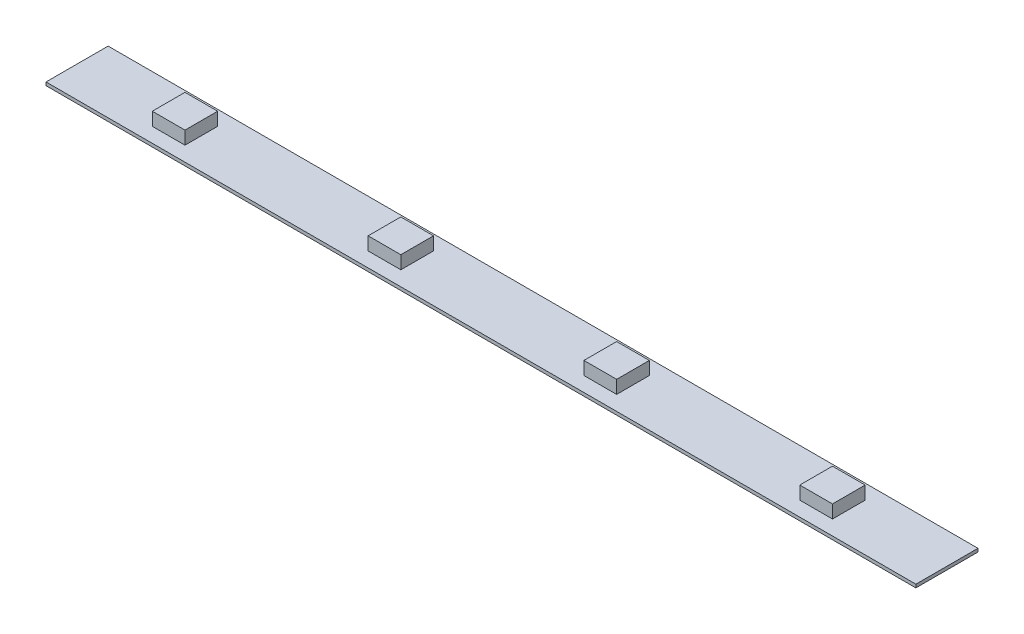
ISO-10303-21;
HEADER;
FILE_DESCRIPTION(('STEP AP214'),'2;1');
FILE_NAME('part.step','',(''),(''),'','','');
FILE_SCHEMA(('AUTOMOTIVE_DESIGN { 1 0 10303 214 1 1 1 1 }'));
ENDSEC;
DATA;
#1=APPLICATION_CONTEXT('core data for automotive mechanical design processes');
#2=APPLICATION_PROTOCOL_DEFINITION('international standard','automotive_design',2000,#1);
#3=PRODUCT_CONTEXT('',#1,'mechanical');
#4=PRODUCT('Part','Part','',(#3));
#5=PRODUCT_RELATED_PRODUCT_CATEGORY('part','',(#4));
#6=PRODUCT_DEFINITION_FORMATION('','',#4);
#7=PRODUCT_DEFINITION_CONTEXT('part definition',#1,'design');
#8=PRODUCT_DEFINITION('design','',#6,#7);
#9=PRODUCT_DEFINITION_SHAPE('','',#8);
#10=(LENGTH_UNIT() NAMED_UNIT(*) SI_UNIT(.MILLI.,.METRE.));
#11=(NAMED_UNIT(*) PLANE_ANGLE_UNIT() SI_UNIT($,.RADIAN.));
#12=(NAMED_UNIT(*) SI_UNIT($,.STERADIAN.) SOLID_ANGLE_UNIT());
#13=UNCERTAINTY_MEASURE_WITH_UNIT(LENGTH_MEASURE(1.E-05),#10,'distance_accuracy_value','');
#14=(GEOMETRIC_REPRESENTATION_CONTEXT(3) GLOBAL_UNCERTAINTY_ASSIGNED_CONTEXT((#13)) GLOBAL_UNIT_ASSIGNED_CONTEXT((#10,
#11,#12)) REPRESENTATION_CONTEXT('',''));
#15=CARTESIAN_POINT('',(0.,0.,0.));
#16=DIRECTION('',(0.,0.,1.));
#17=DIRECTION('',(1.,0.,0.));
#18=AXIS2_PLACEMENT_3D('',#15,#16,#17);
#19=CARTESIAN_POINT('',(0.,0.5,0.));
#20=DIRECTION('',(0.,-1.,0.));
#21=DIRECTION('',(0.,0.,-1.));
#22=AXIS2_PLACEMENT_3D('',#19,#20,#21);
#23=PLANE('',#22);
#24=DIRECTION('',(0.,0.,1.));
#25=VECTOR('',#24,1.);
#26=CARTESIAN_POINT('',(80.,0.5,-7.25));
#27=LINE('',#26,#25);
#28=CARTESIAN_POINT('',(80.,0.5,-7.25));
#29=VERTEX_POINT('',#28);
#30=CARTESIAN_POINT('',(80.,0.5,-2.25));
#31=VERTEX_POINT('',#30);
#32=EDGE_CURVE('E197',#29,#31,#27,.T.);
#33=ORIENTED_EDGE('',*,*,#32,.F.);
#34=DIRECTION('',(-1.,0.,0.));
#35=VECTOR('',#34,1.);
#36=CARTESIAN_POINT('',(80.,0.5,-7.25));
#37=LINE('',#36,#35);
#38=CARTESIAN_POINT('',(85.,0.5,-7.25));
#39=VERTEX_POINT('',#38);
#40=EDGE_CURVE('E210',#39,#29,#37,.T.);
#41=ORIENTED_EDGE('',*,*,#40,.F.);
#42=DIRECTION('',(0.,0.,-1.));
#43=VECTOR('',#42,1.);
#44=CARTESIAN_POINT('',(85.,0.5,-7.25));
#45=LINE('',#44,#43);
#46=CARTESIAN_POINT('',(85.,0.5,-2.25));
#47=VERTEX_POINT('',#46);
#48=EDGE_CURVE('E219',#47,#39,#45,.T.);
#49=ORIENTED_EDGE('',*,*,#48,.F.);
#50=DIRECTION('',(1.,0.,0.));
#51=VECTOR('',#50,1.);
#52=CARTESIAN_POINT('',(80.,0.5,-2.25));
#53=LINE('',#52,#51);
#54=EDGE_CURVE('E200',#31,#47,#53,.T.);
#55=ORIENTED_EDGE('',*,*,#54,.F.);
#56=EDGE_LOOP('',(#33,#41,#49,#55));
#57=FACE_BOUND('',#56,.T.);
#58=DIRECTION('',(0.,0.,1.));
#59=VECTOR('',#58,1.);
#60=CARTESIAN_POINT('',(14.,0.5,-7.25));
#61=LINE('',#60,#59);
#62=CARTESIAN_POINT('',(14.,0.5,-7.25));
#63=VERTEX_POINT('',#62);
#64=CARTESIAN_POINT('',(14.,0.5,-2.25));
#65=VERTEX_POINT('',#64);
#66=EDGE_CURVE('E268',#63,#65,#61,.T.);
#67=ORIENTED_EDGE('',*,*,#66,.F.);
#68=DIRECTION('',(-1.,0.,0.));
#69=VECTOR('',#68,1.);
#70=CARTESIAN_POINT('',(14.,0.5,-7.25));
#71=LINE('',#70,#69);
#72=CARTESIAN_POINT('',(19.,0.5,-7.25));
#73=VERTEX_POINT('',#72);
#74=EDGE_CURVE('E273',#73,#63,#71,.T.);
#75=ORIENTED_EDGE('',*,*,#74,.F.);
#76=DIRECTION('',(0.,0.,-1.));
#77=VECTOR('',#76,1.);
#78=CARTESIAN_POINT('',(19.,0.5,-7.25));
#79=LINE('',#78,#77);
#80=CARTESIAN_POINT('',(19.,0.5,-2.25));
#81=VERTEX_POINT('',#80);
#82=EDGE_CURVE('E285',#81,#73,#79,.T.);
#83=ORIENTED_EDGE('',*,*,#82,.F.);
#84=DIRECTION('',(1.,0.,0.));
#85=VECTOR('',#84,1.);
#86=CARTESIAN_POINT('',(14.,0.5,-2.25));
#87=LINE('',#86,#85);
#88=EDGE_CURVE('E282',#65,#81,#87,.T.);
#89=ORIENTED_EDGE('',*,*,#88,.F.);
#90=EDGE_LOOP('',(#67,#75,#83,#89));
#91=FACE_BOUND('',#90,.T.);
#92=DIRECTION('',(0.,0.,1.));
#93=VECTOR('',#92,1.);
#94=CARTESIAN_POINT('',(0.,0.5,0.));
#95=LINE('',#94,#93);
#96=CARTESIAN_POINT('',(0.,0.5,-9.5));
#97=VERTEX_POINT('',#96);
#98=CARTESIAN_POINT('',(0.,0.5,0.));
#99=VERTEX_POINT('',#98);
#100=EDGE_CURVE('E302',#97,#99,#95,.T.);
#101=ORIENTED_EDGE('',*,*,#100,.T.);
#102=DIRECTION('',(1.,0.,0.));
#103=VECTOR('',#102,1.);
#104=CARTESIAN_POINT('',(0.,0.5,0.));
#105=LINE('',#104,#103);
#106=CARTESIAN_POINT('',(133.,0.5,0.));
#107=VERTEX_POINT('',#106);
#108=EDGE_CURVE('E305',#99,#107,#105,.T.);
#109=ORIENTED_EDGE('',*,*,#108,.T.);
#110=DIRECTION('',(0.,0.,-1.));
#111=VECTOR('',#110,1.);
#112=CARTESIAN_POINT('',(133.,0.5,0.));
#113=LINE('',#112,#111);
#114=CARTESIAN_POINT('',(133.,0.5,-9.5));
#115=VERTEX_POINT('',#114);
#116=EDGE_CURVE('E308',#107,#115,#113,.T.);
#117=ORIENTED_EDGE('',*,*,#116,.T.);
#118=DIRECTION('',(-1.,0.,0.));
#119=VECTOR('',#118,1.);
#120=CARTESIAN_POINT('',(0.,0.5,-9.5));
#121=LINE('',#120,#119);
#122=EDGE_CURVE('E310',#115,#97,#121,.T.);
#123=ORIENTED_EDGE('',*,*,#122,.T.);
#124=EDGE_LOOP('',(#101,#109,#117,#123));
#125=FACE_BOUND('',#124,.T.);
#126=DIRECTION('',(0.,0.,1.));
#127=VECTOR('',#126,1.);
#128=CARTESIAN_POINT('',(47.,0.5,-7.25));
#129=LINE('',#128,#127);
#130=CARTESIAN_POINT('',(47.,0.5,-7.25));
#131=VERTEX_POINT('',#130);
#132=CARTESIAN_POINT('',(47.,0.5,-2.25));
#133=VERTEX_POINT('',#132);
#134=EDGE_CURVE('E235',#131,#133,#129,.T.);
#135=ORIENTED_EDGE('',*,*,#134,.F.);
#136=DIRECTION('',(-1.,0.,0.));
#137=VECTOR('',#136,1.);
#138=CARTESIAN_POINT('',(47.,0.5,-7.25));
#139=LINE('',#138,#137);
#140=CARTESIAN_POINT('',(52.,0.5,-7.25));
#141=VERTEX_POINT('',#140);
#142=EDGE_CURVE('E240',#141,#131,#139,.T.);
#143=ORIENTED_EDGE('',*,*,#142,.F.);
#144=DIRECTION('',(0.,0.,-1.));
#145=VECTOR('',#144,1.);
#146=CARTESIAN_POINT('',(52.,0.5,-7.25));
#147=LINE('',#146,#145);
#148=CARTESIAN_POINT('',(52.,0.5,-2.25));
#149=VERTEX_POINT('',#148);
#150=EDGE_CURVE('E252',#149,#141,#147,.T.);
#151=ORIENTED_EDGE('',*,*,#150,.F.);
#152=DIRECTION('',(1.,0.,0.));
#153=VECTOR('',#152,1.);
#154=CARTESIAN_POINT('',(47.,0.5,-2.25));
#155=LINE('',#154,#153);
#156=EDGE_CURVE('E249',#133,#149,#155,.T.);
#157=ORIENTED_EDGE('',*,*,#156,.F.);
#158=EDGE_LOOP('',(#135,#143,#151,#157));
#159=FACE_BOUND('',#158,.T.);
#160=DIRECTION('',(0.,0.,1.));
#161=VECTOR('',#160,1.);
#162=CARTESIAN_POINT('',(113.,0.5,-7.25));
#163=LINE('',#162,#161);
#164=CARTESIAN_POINT('',(113.,0.5,-7.25));
#165=VERTEX_POINT('',#164);
#166=CARTESIAN_POINT('',(113.,0.5,-2.25));
#167=VERTEX_POINT('',#166);
#168=EDGE_CURVE('E196',#165,#167,#163,.T.);
#169=ORIENTED_EDGE('',*,*,#168,.F.);
#170=DIRECTION('',(-1.,0.,0.));
#171=VECTOR('',#170,1.);
#172=CARTESIAN_POINT('',(113.,0.5,-7.25));
#173=LINE('',#172,#171);
#174=CARTESIAN_POINT('',(118.,0.5,-7.25));
#175=VERTEX_POINT('',#174);
#176=EDGE_CURVE('E193',#175,#165,#173,.T.);
#177=ORIENTED_EDGE('',*,*,#176,.F.);
#178=DIRECTION('',(0.,0.,-1.));
#179=VECTOR('',#178,1.);
#180=CARTESIAN_POINT('',(118.,0.5,-7.25));
#181=LINE('',#180,#179);
#182=CARTESIAN_POINT('',(118.,0.5,-2.25));
#183=VERTEX_POINT('',#182);
#184=EDGE_CURVE('E59',#183,#175,#181,.T.);
#185=ORIENTED_EDGE('',*,*,#184,.F.);
#186=DIRECTION('',(1.,0.,0.));
#187=VECTOR('',#186,1.);
#188=CARTESIAN_POINT('',(113.,0.5,-2.25));
#189=LINE('',#188,#187);
#190=EDGE_CURVE('E54',#167,#183,#189,.T.);
#191=ORIENTED_EDGE('',*,*,#190,.F.);
#192=EDGE_LOOP('',(#169,#177,#185,#191));
#193=FACE_BOUND('',#192,.T.);
#194=ADVANCED_FACE('F39',(#57,#91,#125,#159,#193),#23,.F.);
#195=CARTESIAN_POINT('',(0.,0.5,0.));
#196=DIRECTION('',(1.,0.,0.));
#197=DIRECTION('',(0.,0.,-1.));
#198=AXIS2_PLACEMENT_3D('',#195,#196,#197);
#199=PLANE('',#198);
#200=DIRECTION('',(0.,0.,1.));
#201=VECTOR('',#200,1.);
#202=CARTESIAN_POINT('',(0.,0.,0.));
#203=LINE('',#202,#201);
#204=CARTESIAN_POINT('',(0.,0.,-9.5));
#205=VERTEX_POINT('',#204);
#206=CARTESIAN_POINT('',(0.,0.,0.));
#207=VERTEX_POINT('',#206);
#208=EDGE_CURVE('E301',#205,#207,#203,.T.);
#209=ORIENTED_EDGE('',*,*,#208,.T.);
#210=DIRECTION('',(0.,-1.,0.));
#211=VECTOR('',#210,1.);
#212=CARTESIAN_POINT('',(0.,0.5,0.));
#213=LINE('',#212,#211);
#214=EDGE_CURVE('E11',#99,#207,#213,.T.);
#215=ORIENTED_EDGE('',*,*,#214,.F.);
#216=ORIENTED_EDGE('',*,*,#100,.F.);
#217=DIRECTION('',(0.,-1.,0.));
#218=VECTOR('',#217,1.);
#219=CARTESIAN_POINT('',(0.,0.5,-9.5));
#220=LINE('',#219,#218);
#221=EDGE_CURVE('E312',#97,#205,#220,.T.);
#222=ORIENTED_EDGE('',*,*,#221,.T.);
#223=EDGE_LOOP('',(#209,#215,#216,#222));
#224=FACE_BOUND('',#223,.T.);
#225=ADVANCED_FACE('F41',(#224),#199,.F.);
#226=CARTESIAN_POINT('',(0.,0.5,0.));
#227=DIRECTION('',(0.,0.,-1.));
#228=DIRECTION('',(-1.,0.,0.));
#229=AXIS2_PLACEMENT_3D('',#226,#227,#228);
#230=PLANE('',#229);
#231=DIRECTION('',(1.,0.,0.));
#232=VECTOR('',#231,1.);
#233=CARTESIAN_POINT('',(0.,0.,0.));
#234=LINE('',#233,#232);
#235=CARTESIAN_POINT('',(133.,0.,0.));
#236=VERTEX_POINT('',#235);
#237=EDGE_CURVE('E315',#207,#236,#234,.T.);
#238=ORIENTED_EDGE('',*,*,#237,.T.);
#239=DIRECTION('',(0.,-1.,0.));
#240=VECTOR('',#239,1.);
#241=CARTESIAN_POINT('',(133.,0.5,0.));
#242=LINE('',#241,#240);
#243=EDGE_CURVE('E47',#107,#236,#242,.T.);
#244=ORIENTED_EDGE('',*,*,#243,.F.);
#245=ORIENTED_EDGE('',*,*,#108,.F.);
#246=ORIENTED_EDGE('',*,*,#214,.T.);
#247=EDGE_LOOP('',(#238,#244,#245,#246));
#248=FACE_BOUND('',#247,.T.);
#249=ADVANCED_FACE('F345',(#248),#230,.F.);
#250=CARTESIAN_POINT('',(133.,0.5,0.));
#251=DIRECTION('',(-1.,0.,0.));
#252=DIRECTION('',(0.,0.,1.));
#253=AXIS2_PLACEMENT_3D('',#250,#251,#252);
#254=PLANE('',#253);
#255=DIRECTION('',(0.,0.,-1.));
#256=VECTOR('',#255,1.);
#257=CARTESIAN_POINT('',(133.,0.,0.));
#258=LINE('',#257,#256);
#259=CARTESIAN_POINT('',(133.,0.,-9.5));
#260=VERTEX_POINT('',#259);
#261=EDGE_CURVE('E317',#236,#260,#258,.T.);
#262=ORIENTED_EDGE('',*,*,#261,.T.);
#263=DIRECTION('',(0.,-1.,0.));
#264=VECTOR('',#263,1.);
#265=CARTESIAN_POINT('',(133.,0.5,-9.5));
#266=LINE('',#265,#264);
#267=EDGE_CURVE('E322',#115,#260,#266,.T.);
#268=ORIENTED_EDGE('',*,*,#267,.F.);
#269=ORIENTED_EDGE('',*,*,#116,.F.);
#270=ORIENTED_EDGE('',*,*,#243,.T.);
#271=EDGE_LOOP('',(#262,#268,#269,#270));
#272=FACE_BOUND('',#271,.T.);
#273=ADVANCED_FACE('F329',(#272),#254,.F.);
#274=CARTESIAN_POINT('',(0.,0.5,-9.5));
#275=DIRECTION('',(0.,0.,1.));
#276=DIRECTION('',(1.,0.,0.));
#277=AXIS2_PLACEMENT_3D('',#274,#275,#276);
#278=PLANE('',#277);
#279=DIRECTION('',(-1.,0.,0.));
#280=VECTOR('',#279,1.);
#281=CARTESIAN_POINT('',(0.,0.,-9.5));
#282=LINE('',#281,#280);
#283=EDGE_CURVE('E306',#260,#205,#282,.T.);
#284=ORIENTED_EDGE('',*,*,#283,.T.);
#285=ORIENTED_EDGE('',*,*,#221,.F.);
#286=ORIENTED_EDGE('',*,*,#122,.F.);
#287=ORIENTED_EDGE('',*,*,#267,.T.);
#288=EDGE_LOOP('',(#284,#285,#286,#287));
#289=FACE_BOUND('',#288,.T.);
#290=ADVANCED_FACE('F338',(#289),#278,.F.);
#291=CARTESIAN_POINT('',(0.,0.,0.));
#292=DIRECTION('',(0.,-1.,0.));
#293=DIRECTION('',(0.,0.,-1.));
#294=AXIS2_PLACEMENT_3D('',#291,#292,#293);
#295=PLANE('',#294);
#296=ORIENTED_EDGE('',*,*,#208,.F.);
#297=ORIENTED_EDGE('',*,*,#283,.F.);
#298=ORIENTED_EDGE('',*,*,#261,.F.);
#299=ORIENTED_EDGE('',*,*,#237,.F.);
#300=EDGE_LOOP('',(#296,#297,#298,#299));
#301=FACE_BOUND('',#300,.T.);
#302=ADVANCED_FACE('F335',(#301),#295,.T.);
#303=CARTESIAN_POINT('',(14.,2.5,-7.25));
#304=DIRECTION('',(1.,0.,0.));
#305=DIRECTION('',(0.,0.,-1.));
#306=AXIS2_PLACEMENT_3D('',#303,#304,#305);
#307=PLANE('',#306);
#308=ORIENTED_EDGE('',*,*,#66,.T.);
#309=DIRECTION('',(0.,-1.,0.));
#310=VECTOR('',#309,1.);
#311=CARTESIAN_POINT('',(14.,2.5,-2.25));
#312=LINE('',#311,#310);
#313=CARTESIAN_POINT('',(14.,2.5,-2.25));
#314=VERTEX_POINT('',#313);
#315=EDGE_CURVE('E298',#314,#65,#312,.T.);
#316=ORIENTED_EDGE('',*,*,#315,.F.);
#317=DIRECTION('',(0.,0.,1.));
#318=VECTOR('',#317,1.);
#319=CARTESIAN_POINT('',(14.,2.5,-7.25));
#320=LINE('',#319,#318);
#321=CARTESIAN_POINT('',(14.,2.5,-7.25));
#322=VERTEX_POINT('',#321);
#323=EDGE_CURVE('E269',#322,#314,#320,.T.);
#324=ORIENTED_EDGE('',*,*,#323,.F.);
#325=DIRECTION('',(0.,-1.,0.));
#326=VECTOR('',#325,1.);
#327=CARTESIAN_POINT('',(14.,2.5,-7.25));
#328=LINE('',#327,#326);
#329=EDGE_CURVE('E279',#322,#63,#328,.T.);
#330=ORIENTED_EDGE('',*,*,#329,.T.);
#331=EDGE_LOOP('',(#308,#316,#324,#330));
#332=FACE_BOUND('',#331,.T.);
#333=ADVANCED_FACE('F362',(#332),#307,.F.);
#334=CARTESIAN_POINT('',(14.,2.5,-2.25));
#335=DIRECTION('',(0.,0.,-1.));
#336=DIRECTION('',(-1.,0.,0.));
#337=AXIS2_PLACEMENT_3D('',#334,#335,#336);
#338=PLANE('',#337);
#339=ORIENTED_EDGE('',*,*,#88,.T.);
#340=DIRECTION('',(0.,-1.,0.));
#341=VECTOR('',#340,1.);
#342=CARTESIAN_POINT('',(19.,2.5,-2.25));
#343=LINE('',#342,#341);
#344=CARTESIAN_POINT('',(19.,2.5,-2.25));
#345=VERTEX_POINT('',#344);
#346=EDGE_CURVE('E295',#345,#81,#343,.T.);
#347=ORIENTED_EDGE('',*,*,#346,.F.);
#348=DIRECTION('',(1.,0.,0.));
#349=VECTOR('',#348,1.);
#350=CARTESIAN_POINT('',(14.,2.5,-2.25));
#351=LINE('',#350,#349);
#352=EDGE_CURVE('E272',#314,#345,#351,.T.);
#353=ORIENTED_EDGE('',*,*,#352,.F.);
#354=ORIENTED_EDGE('',*,*,#315,.T.);
#355=EDGE_LOOP('',(#339,#347,#353,#354));
#356=FACE_BOUND('',#355,.T.);
#357=ADVANCED_FACE('F382',(#356),#338,.F.);
#358=CARTESIAN_POINT('',(19.,2.5,-7.25));
#359=DIRECTION('',(-1.,0.,0.));
#360=DIRECTION('',(0.,0.,1.));
#361=AXIS2_PLACEMENT_3D('',#358,#359,#360);
#362=PLANE('',#361);
#363=ORIENTED_EDGE('',*,*,#82,.T.);
#364=DIRECTION('',(0.,-1.,0.));
#365=VECTOR('',#364,1.);
#366=CARTESIAN_POINT('',(19.,2.5,-7.25));
#367=LINE('',#366,#365);
#368=CARTESIAN_POINT('',(19.,2.5,-7.25));
#369=VERTEX_POINT('',#368);
#370=EDGE_CURVE('E292',#369,#73,#367,.T.);
#371=ORIENTED_EDGE('',*,*,#370,.F.);
#372=DIRECTION('',(0.,0.,-1.));
#373=VECTOR('',#372,1.);
#374=CARTESIAN_POINT('',(19.,2.5,-7.25));
#375=LINE('',#374,#373);
#376=EDGE_CURVE('E275',#345,#369,#375,.T.);
#377=ORIENTED_EDGE('',*,*,#376,.F.);
#378=ORIENTED_EDGE('',*,*,#346,.T.);
#379=EDGE_LOOP('',(#363,#371,#377,#378));
#380=FACE_BOUND('',#379,.T.);
#381=ADVANCED_FACE('F389',(#380),#362,.F.);
#382=CARTESIAN_POINT('',(14.,2.5,-7.25));
#383=DIRECTION('',(0.,0.,1.));
#384=DIRECTION('',(1.,0.,0.));
#385=AXIS2_PLACEMENT_3D('',#382,#383,#384);
#386=PLANE('',#385);
#387=ORIENTED_EDGE('',*,*,#74,.T.);
#388=ORIENTED_EDGE('',*,*,#329,.F.);
#389=DIRECTION('',(-1.,0.,0.));
#390=VECTOR('',#389,1.);
#391=CARTESIAN_POINT('',(14.,2.5,-7.25));
#392=LINE('',#391,#390);
#393=EDGE_CURVE('E277',#369,#322,#392,.T.);
#394=ORIENTED_EDGE('',*,*,#393,.F.);
#395=ORIENTED_EDGE('',*,*,#370,.T.);
#396=EDGE_LOOP('',(#387,#388,#394,#395));
#397=FACE_BOUND('',#396,.T.);
#398=ADVANCED_FACE('F396',(#397),#386,.F.);
#399=CARTESIAN_POINT('',(0.,2.5,0.));
#400=DIRECTION('',(0.,1.,0.));
#401=DIRECTION('',(0.,0.,1.));
#402=AXIS2_PLACEMENT_3D('',#399,#400,#401);
#403=PLANE('',#402);
#404=ORIENTED_EDGE('',*,*,#323,.T.);
#405=ORIENTED_EDGE('',*,*,#352,.T.);
#406=ORIENTED_EDGE('',*,*,#376,.T.);
#407=ORIENTED_EDGE('',*,*,#393,.T.);
#408=EDGE_LOOP('',(#404,#405,#406,#407));
#409=FACE_BOUND('',#408,.T.);
#410=ADVANCED_FACE('F404',(#409),#403,.T.);
#411=CARTESIAN_POINT('',(47.,2.5,-7.25));
#412=DIRECTION('',(1.,0.,0.));
#413=DIRECTION('',(0.,0.,-1.));
#414=AXIS2_PLACEMENT_3D('',#411,#412,#413);
#415=PLANE('',#414);
#416=ORIENTED_EDGE('',*,*,#134,.T.);
#417=DIRECTION('',(0.,-1.,0.));
#418=VECTOR('',#417,1.);
#419=CARTESIAN_POINT('',(47.,2.5,-2.25));
#420=LINE('',#419,#418);
#421=CARTESIAN_POINT('',(47.,2.5,-2.25));
#422=VERTEX_POINT('',#421);
#423=EDGE_CURVE('E265',#422,#133,#420,.T.);
#424=ORIENTED_EDGE('',*,*,#423,.F.);
#425=DIRECTION('',(0.,0.,1.));
#426=VECTOR('',#425,1.);
#427=CARTESIAN_POINT('',(47.,2.5,-7.25));
#428=LINE('',#427,#426);
#429=CARTESIAN_POINT('',(47.,2.5,-7.25));
#430=VERTEX_POINT('',#429);
#431=EDGE_CURVE('E236',#430,#422,#428,.T.);
#432=ORIENTED_EDGE('',*,*,#431,.F.);
#433=DIRECTION('',(0.,-1.,0.));
#434=VECTOR('',#433,1.);
#435=CARTESIAN_POINT('',(47.,2.5,-7.25));
#436=LINE('',#435,#434);
#437=EDGE_CURVE('E246',#430,#131,#436,.T.);
#438=ORIENTED_EDGE('',*,*,#437,.T.);
#439=EDGE_LOOP('',(#416,#424,#432,#438));
#440=FACE_BOUND('',#439,.T.);
#441=ADVANCED_FACE('F412',(#440),#415,.F.);
#442=CARTESIAN_POINT('',(47.,2.5,-2.25));
#443=DIRECTION('',(0.,0.,-1.));
#444=DIRECTION('',(-1.,0.,0.));
#445=AXIS2_PLACEMENT_3D('',#442,#443,#444);
#446=PLANE('',#445);
#447=ORIENTED_EDGE('',*,*,#156,.T.);
#448=DIRECTION('',(0.,-1.,0.));
#449=VECTOR('',#448,1.);
#450=CARTESIAN_POINT('',(52.,2.5,-2.25));
#451=LINE('',#450,#449);
#452=CARTESIAN_POINT('',(52.,2.5,-2.25));
#453=VERTEX_POINT('',#452);
#454=EDGE_CURVE('E262',#453,#149,#451,.T.);
#455=ORIENTED_EDGE('',*,*,#454,.F.);
#456=DIRECTION('',(1.,0.,0.));
#457=VECTOR('',#456,1.);
#458=CARTESIAN_POINT('',(47.,2.5,-2.25));
#459=LINE('',#458,#457);
#460=EDGE_CURVE('E239',#422,#453,#459,.T.);
#461=ORIENTED_EDGE('',*,*,#460,.F.);
#462=ORIENTED_EDGE('',*,*,#423,.T.);
#463=EDGE_LOOP('',(#447,#455,#461,#462));
#464=FACE_BOUND('',#463,.T.);
#465=ADVANCED_FACE('F420',(#464),#446,.F.);
#466=CARTESIAN_POINT('',(52.,2.5,-7.25));
#467=DIRECTION('',(-1.,0.,0.));
#468=DIRECTION('',(0.,0.,1.));
#469=AXIS2_PLACEMENT_3D('',#466,#467,#468);
#470=PLANE('',#469);
#471=ORIENTED_EDGE('',*,*,#150,.T.);
#472=DIRECTION('',(0.,-1.,0.));
#473=VECTOR('',#472,1.);
#474=CARTESIAN_POINT('',(52.,2.5,-7.25));
#475=LINE('',#474,#473);
#476=CARTESIAN_POINT('',(52.,2.5,-7.25));
#477=VERTEX_POINT('',#476);
#478=EDGE_CURVE('E259',#477,#141,#475,.T.);
#479=ORIENTED_EDGE('',*,*,#478,.F.);
#480=DIRECTION('',(0.,0.,-1.));
#481=VECTOR('',#480,1.);
#482=CARTESIAN_POINT('',(52.,2.5,-7.25));
#483=LINE('',#482,#481);
#484=EDGE_CURVE('E242',#453,#477,#483,.T.);
#485=ORIENTED_EDGE('',*,*,#484,.F.);
#486=ORIENTED_EDGE('',*,*,#454,.T.);
#487=EDGE_LOOP('',(#471,#479,#485,#486));
#488=FACE_BOUND('',#487,.T.);
#489=ADVANCED_FACE('F428',(#488),#470,.F.);
#490=CARTESIAN_POINT('',(47.,2.5,-7.25));
#491=DIRECTION('',(0.,0.,1.));
#492=DIRECTION('',(1.,0.,0.));
#493=AXIS2_PLACEMENT_3D('',#490,#491,#492);
#494=PLANE('',#493);
#495=ORIENTED_EDGE('',*,*,#142,.T.);
#496=ORIENTED_EDGE('',*,*,#437,.F.);
#497=DIRECTION('',(-1.,0.,0.));
#498=VECTOR('',#497,1.);
#499=CARTESIAN_POINT('',(47.,2.5,-7.25));
#500=LINE('',#499,#498);
#501=EDGE_CURVE('E244',#477,#430,#500,.T.);
#502=ORIENTED_EDGE('',*,*,#501,.F.);
#503=ORIENTED_EDGE('',*,*,#478,.T.);
#504=EDGE_LOOP('',(#495,#496,#502,#503));
#505=FACE_BOUND('',#504,.T.);
#506=ADVANCED_FACE('F436',(#505),#494,.F.);
#507=CARTESIAN_POINT('',(0.,2.5,0.));
#508=DIRECTION('',(0.,1.,0.));
#509=DIRECTION('',(0.,0.,1.));
#510=AXIS2_PLACEMENT_3D('',#507,#508,#509);
#511=PLANE('',#510);
#512=ORIENTED_EDGE('',*,*,#431,.T.);
#513=ORIENTED_EDGE('',*,*,#460,.T.);
#514=ORIENTED_EDGE('',*,*,#484,.T.);
#515=ORIENTED_EDGE('',*,*,#501,.T.);
#516=EDGE_LOOP('',(#512,#513,#514,#515));
#517=FACE_BOUND('',#516,.T.);
#518=ADVANCED_FACE('F444',(#517),#511,.T.);
#519=CARTESIAN_POINT('',(80.,2.5,-7.25));
#520=DIRECTION('',(1.,0.,0.));
#521=DIRECTION('',(0.,0.,-1.));
#522=AXIS2_PLACEMENT_3D('',#519,#520,#521);
#523=PLANE('',#522);
#524=ORIENTED_EDGE('',*,*,#32,.T.);
#525=DIRECTION('',(0.,-1.,0.));
#526=VECTOR('',#525,1.);
#527=CARTESIAN_POINT('',(80.,2.5,-2.25));
#528=LINE('',#527,#526);
#529=CARTESIAN_POINT('',(80.,2.5,-2.25));
#530=VERTEX_POINT('',#529);
#531=EDGE_CURVE('E232',#530,#31,#528,.T.);
#532=ORIENTED_EDGE('',*,*,#531,.F.);
#533=DIRECTION('',(0.,0.,1.));
#534=VECTOR('',#533,1.);
#535=CARTESIAN_POINT('',(80.,2.5,-7.25));
#536=LINE('',#535,#534);
#537=CARTESIAN_POINT('',(80.,2.5,-7.25));
#538=VERTEX_POINT('',#537);
#539=EDGE_CURVE('E206',#538,#530,#536,.T.);
#540=ORIENTED_EDGE('',*,*,#539,.F.);
#541=DIRECTION('',(0.,-1.,0.));
#542=VECTOR('',#541,1.);
#543=CARTESIAN_POINT('',(80.,2.5,-7.25));
#544=LINE('',#543,#542);
#545=EDGE_CURVE('E215',#538,#29,#544,.T.);
#546=ORIENTED_EDGE('',*,*,#545,.T.);
#547=EDGE_LOOP('',(#524,#532,#540,#546));
#548=FACE_BOUND('',#547,.T.);
#549=ADVANCED_FACE('F452',(#548),#523,.F.);
#550=CARTESIAN_POINT('',(80.,2.5,-2.25));
#551=DIRECTION('',(0.,0.,-1.));
#552=DIRECTION('',(-1.,0.,0.));
#553=AXIS2_PLACEMENT_3D('',#550,#551,#552);
#554=PLANE('',#553);
#555=ORIENTED_EDGE('',*,*,#54,.T.);
#556=DIRECTION('',(0.,-1.,0.));
#557=VECTOR('',#556,1.);
#558=CARTESIAN_POINT('',(85.,2.5,-2.25));
#559=LINE('',#558,#557);
#560=CARTESIAN_POINT('',(85.,2.5,-2.25));
#561=VERTEX_POINT('',#560);
#562=EDGE_CURVE('E229',#561,#47,#559,.T.);
#563=ORIENTED_EDGE('',*,*,#562,.F.);
#564=DIRECTION('',(1.,0.,0.));
#565=VECTOR('',#564,1.);
#566=CARTESIAN_POINT('',(80.,2.5,-2.25));
#567=LINE('',#566,#565);
#568=EDGE_CURVE('E209',#530,#561,#567,.T.);
#569=ORIENTED_EDGE('',*,*,#568,.F.);
#570=ORIENTED_EDGE('',*,*,#531,.T.);
#571=EDGE_LOOP('',(#555,#563,#569,#570));
#572=FACE_BOUND('',#571,.T.);
#573=ADVANCED_FACE('F460',(#572),#554,.F.);
#574=CARTESIAN_POINT('',(85.,2.5,-7.25));
#575=DIRECTION('',(-1.,0.,0.));
#576=DIRECTION('',(0.,0.,1.));
#577=AXIS2_PLACEMENT_3D('',#574,#575,#576);
#578=PLANE('',#577);
#579=ORIENTED_EDGE('',*,*,#48,.T.);
#580=DIRECTION('',(0.,-1.,0.));
#581=VECTOR('',#580,1.);
#582=CARTESIAN_POINT('',(85.,2.5,-7.25));
#583=LINE('',#582,#581);
#584=CARTESIAN_POINT('',(85.,2.5,-7.25));
#585=VERTEX_POINT('',#584);
#586=EDGE_CURVE('E226',#585,#39,#583,.T.);
#587=ORIENTED_EDGE('',*,*,#586,.F.);
#588=DIRECTION('',(0.,0.,-1.));
#589=VECTOR('',#588,1.);
#590=CARTESIAN_POINT('',(85.,2.5,-7.25));
#591=LINE('',#590,#589);
#592=EDGE_CURVE('E212',#561,#585,#591,.T.);
#593=ORIENTED_EDGE('',*,*,#592,.F.);
#594=ORIENTED_EDGE('',*,*,#562,.T.);
#595=EDGE_LOOP('',(#579,#587,#593,#594));
#596=FACE_BOUND('',#595,.T.);
#597=ADVANCED_FACE('F468',(#596),#578,.F.);
#598=CARTESIAN_POINT('',(80.,2.5,-7.25));
#599=DIRECTION('',(0.,0.,1.));
#600=DIRECTION('',(1.,0.,0.));
#601=AXIS2_PLACEMENT_3D('',#598,#599,#600);
#602=PLANE('',#601);
#603=ORIENTED_EDGE('',*,*,#40,.T.);
#604=ORIENTED_EDGE('',*,*,#545,.F.);
#605=DIRECTION('',(-1.,0.,0.));
#606=VECTOR('',#605,1.);
#607=CARTESIAN_POINT('',(80.,2.5,-7.25));
#608=LINE('',#607,#606);
#609=EDGE_CURVE('E214',#585,#538,#608,.T.);
#610=ORIENTED_EDGE('',*,*,#609,.F.);
#611=ORIENTED_EDGE('',*,*,#586,.T.);
#612=EDGE_LOOP('',(#603,#604,#610,#611));
#613=FACE_BOUND('',#612,.T.);
#614=ADVANCED_FACE('F476',(#613),#602,.F.);
#615=CARTESIAN_POINT('',(0.,2.5,0.));
#616=DIRECTION('',(0.,1.,0.));
#617=DIRECTION('',(0.,0.,1.));
#618=AXIS2_PLACEMENT_3D('',#615,#616,#617);
#619=PLANE('',#618);
#620=ORIENTED_EDGE('',*,*,#539,.T.);
#621=ORIENTED_EDGE('',*,*,#568,.T.);
#622=ORIENTED_EDGE('',*,*,#592,.T.);
#623=ORIENTED_EDGE('',*,*,#609,.T.);
#624=EDGE_LOOP('',(#620,#621,#622,#623));
#625=FACE_BOUND('',#624,.T.);
#626=ADVANCED_FACE('F484',(#625),#619,.T.);
#627=CARTESIAN_POINT('',(113.,2.5,-7.25));
#628=DIRECTION('',(1.,0.,0.));
#629=DIRECTION('',(0.,0.,-1.));
#630=AXIS2_PLACEMENT_3D('',#627,#628,#629);
#631=PLANE('',#630);
#632=ORIENTED_EDGE('',*,*,#168,.T.);
#633=DIRECTION('',(0.,-1.,0.));
#634=VECTOR('',#633,1.);
#635=CARTESIAN_POINT('',(113.,2.5,-2.25));
#636=LINE('',#635,#634);
#637=CARTESIAN_POINT('',(113.,2.5,-2.25));
#638=VERTEX_POINT('',#637);
#639=EDGE_CURVE('E177',#638,#167,#636,.T.);
#640=ORIENTED_EDGE('',*,*,#639,.F.);
#641=DIRECTION('',(0.,0.,1.));
#642=VECTOR('',#641,1.);
#643=CARTESIAN_POINT('',(113.,2.5,-7.25));
#644=LINE('',#643,#642);
#645=CARTESIAN_POINT('',(113.,2.5,-7.25));
#646=VERTEX_POINT('',#645);
#647=EDGE_CURVE('E184',#646,#638,#644,.T.);
#648=ORIENTED_EDGE('',*,*,#647,.F.);
#649=DIRECTION('',(0.,-1.,0.));
#650=VECTOR('',#649,1.);
#651=CARTESIAN_POINT('',(113.,2.5,-7.25));
#652=LINE('',#651,#650);
#653=EDGE_CURVE('E530',#646,#165,#652,.T.);
#654=ORIENTED_EDGE('',*,*,#653,.T.);
#655=EDGE_LOOP('',(#632,#640,#648,#654));
#656=FACE_BOUND('',#655,.T.);
#657=ADVANCED_FACE('F195',(#656),#631,.F.);
#658=CARTESIAN_POINT('',(113.,2.5,-2.25));
#659=DIRECTION('',(0.,0.,-1.));
#660=DIRECTION('',(-1.,0.,0.));
#661=AXIS2_PLACEMENT_3D('',#658,#659,#660);
#662=PLANE('',#661);
#663=ORIENTED_EDGE('',*,*,#190,.T.);
#664=DIRECTION('',(0.,-1.,0.));
#665=VECTOR('',#664,1.);
#666=CARTESIAN_POINT('',(118.,2.5,-2.25));
#667=LINE('',#666,#665);
#668=CARTESIAN_POINT('',(118.,2.5,-2.25));
#669=VERTEX_POINT('',#668);
#670=EDGE_CURVE('E180',#669,#183,#667,.T.);
#671=ORIENTED_EDGE('',*,*,#670,.F.);
#672=DIRECTION('',(1.,0.,0.));
#673=VECTOR('',#672,1.);
#674=CARTESIAN_POINT('',(113.,2.5,-2.25));
#675=LINE('',#674,#673);
#676=EDGE_CURVE('E173',#638,#669,#675,.T.);
#677=ORIENTED_EDGE('',*,*,#676,.F.);
#678=ORIENTED_EDGE('',*,*,#639,.T.);
#679=EDGE_LOOP('',(#663,#671,#677,#678));
#680=FACE_BOUND('',#679,.T.);
#681=ADVANCED_FACE('F175',(#680),#662,.F.);
#682=CARTESIAN_POINT('',(118.,2.5,-7.25));
#683=DIRECTION('',(-1.,0.,0.));
#684=DIRECTION('',(0.,0.,1.));
#685=AXIS2_PLACEMENT_3D('',#682,#683,#684);
#686=PLANE('',#685);
#687=ORIENTED_EDGE('',*,*,#184,.T.);
#688=DIRECTION('',(0.,-1.,0.));
#689=VECTOR('',#688,1.);
#690=CARTESIAN_POINT('',(118.,2.5,-7.25));
#691=LINE('',#690,#689);
#692=CARTESIAN_POINT('',(118.,2.5,-7.25));
#693=VERTEX_POINT('',#692);
#694=EDGE_CURVE('E202',#693,#175,#691,.T.);
#695=ORIENTED_EDGE('',*,*,#694,.F.);
#696=DIRECTION('',(0.,0.,-1.));
#697=VECTOR('',#696,1.);
#698=CARTESIAN_POINT('',(118.,2.5,-7.25));
#699=LINE('',#698,#697);
#700=EDGE_CURVE('E183',#669,#693,#699,.T.);
#701=ORIENTED_EDGE('',*,*,#700,.F.);
#702=ORIENTED_EDGE('',*,*,#670,.T.);
#703=EDGE_LOOP('',(#687,#695,#701,#702));
#704=FACE_BOUND('',#703,.T.);
#705=ADVANCED_FACE('F505',(#704),#686,.F.);
#706=CARTESIAN_POINT('',(113.,2.5,-7.25));
#707=DIRECTION('',(0.,0.,1.));
#708=DIRECTION('',(1.,0.,0.));
#709=AXIS2_PLACEMENT_3D('',#706,#707,#708);
#710=PLANE('',#709);
#711=ORIENTED_EDGE('',*,*,#176,.T.);
#712=ORIENTED_EDGE('',*,*,#653,.F.);
#713=DIRECTION('',(-1.,0.,0.));
#714=VECTOR('',#713,1.);
#715=CARTESIAN_POINT('',(113.,2.5,-7.25));
#716=LINE('',#715,#714);
#717=EDGE_CURVE('E189',#693,#646,#716,.T.);
#718=ORIENTED_EDGE('',*,*,#717,.F.);
#719=ORIENTED_EDGE('',*,*,#694,.T.);
#720=EDGE_LOOP('',(#711,#712,#718,#719));
#721=FACE_BOUND('',#720,.T.);
#722=ADVANCED_FACE('F512',(#721),#710,.F.);
#723=CARTESIAN_POINT('',(0.,2.5,0.));
#724=DIRECTION('',(0.,1.,0.));
#725=DIRECTION('',(0.,0.,1.));
#726=AXIS2_PLACEMENT_3D('',#723,#724,#725);
#727=PLANE('',#726);
#728=ORIENTED_EDGE('',*,*,#647,.T.);
#729=ORIENTED_EDGE('',*,*,#676,.T.);
#730=ORIENTED_EDGE('',*,*,#700,.T.);
#731=ORIENTED_EDGE('',*,*,#717,.T.);
#732=EDGE_LOOP('',(#728,#729,#730,#731));
#733=FACE_BOUND('',#732,.T.);
#734=ADVANCED_FACE('F187',(#733),#727,.T.);
#735=CLOSED_SHELL('',(#194,#225,#249,#273,#290,#302,#333,#357,#381,#398,#410,#441,#465,#489,
#506,#518,#549,#573,#597,#614,#626,#657,#681,#705,#722,#734));
#736=MANIFOLD_SOLID_BREP('B2',#735);
#737=ADVANCED_BREP_SHAPE_REPRESENTATION('',(#18,#736),#14);
#738=SHAPE_DEFINITION_REPRESENTATION(#9,#737);
ENDSEC;
END-ISO-10303-21;
